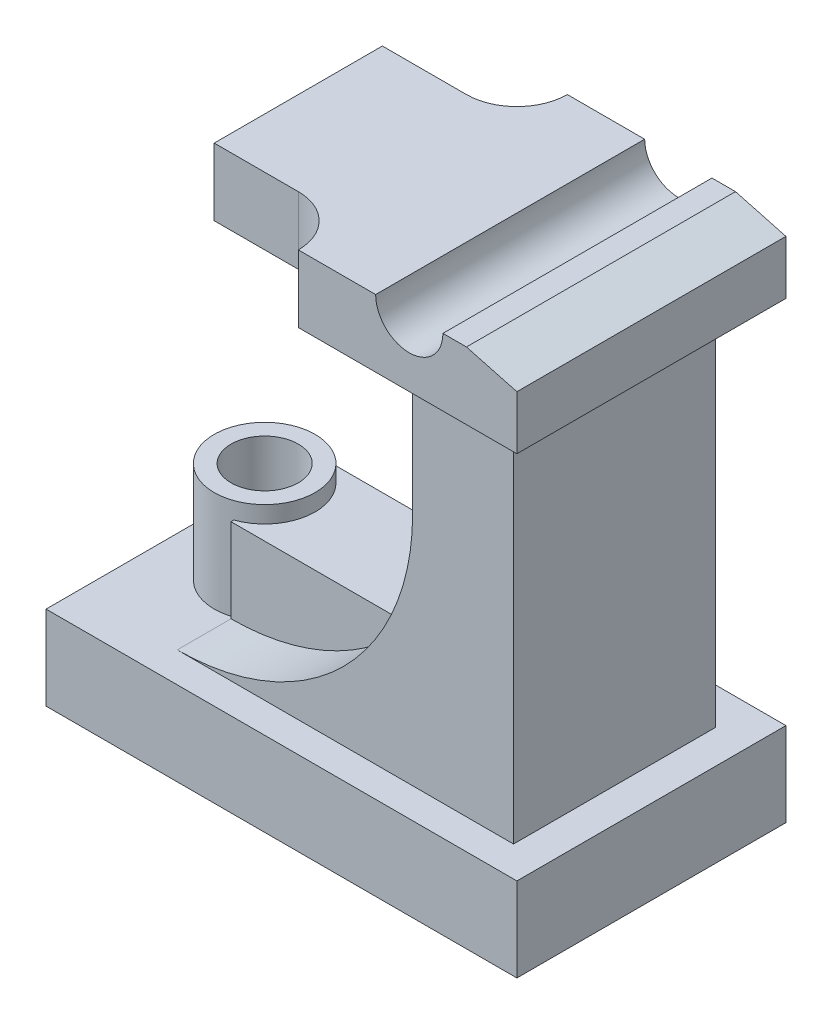
ISO-10303-21;
HEADER;
FILE_DESCRIPTION(('STEP AP214'),'2;1');
FILE_NAME('part.step','',(''),(''),'','','');
FILE_SCHEMA(('AUTOMOTIVE_DESIGN { 1 0 10303 214 1 1 1 1 }'));
ENDSEC;
DATA;
#1=APPLICATION_CONTEXT('core data for automotive mechanical design processes');
#2=APPLICATION_PROTOCOL_DEFINITION('international standard','automotive_design',2000,#1);
#3=PRODUCT_CONTEXT('',#1,'mechanical');
#4=PRODUCT('Part','Part','',(#3));
#5=PRODUCT_RELATED_PRODUCT_CATEGORY('part','',(#4));
#6=PRODUCT_DEFINITION_FORMATION('','',#4);
#7=PRODUCT_DEFINITION_CONTEXT('part definition',#1,'design');
#8=PRODUCT_DEFINITION('design','',#6,#7);
#9=PRODUCT_DEFINITION_SHAPE('','',#8);
#10=(LENGTH_UNIT() NAMED_UNIT(*) SI_UNIT(.MILLI.,.METRE.));
#11=(NAMED_UNIT(*) PLANE_ANGLE_UNIT() SI_UNIT($,.RADIAN.));
#12=(NAMED_UNIT(*) SI_UNIT($,.STERADIAN.) SOLID_ANGLE_UNIT());
#13=UNCERTAINTY_MEASURE_WITH_UNIT(LENGTH_MEASURE(1.E-05),#10,'distance_accuracy_value','');
#14=(GEOMETRIC_REPRESENTATION_CONTEXT(3) GLOBAL_UNCERTAINTY_ASSIGNED_CONTEXT((#13)) GLOBAL_UNIT_ASSIGNED_CONTEXT((#10,
#11,#12)) REPRESENTATION_CONTEXT('',''));
#15=CARTESIAN_POINT('',(0.,0.,0.));
#16=DIRECTION('',(0.,0.,1.));
#17=DIRECTION('',(1.,0.,0.));
#18=AXIS2_PLACEMENT_3D('',#15,#16,#17);
#19=CARTESIAN_POINT('',(0.,135.,0.));
#20=DIRECTION('',(0.,-1.,0.));
#21=DIRECTION('',(0.,0.,-1.));
#22=AXIS2_PLACEMENT_3D('',#19,#20,#21);
#23=PLANE('',#22);
#24=DIRECTION('',(1.,0.,0.));
#25=VECTOR('',#24,1.);
#26=CARTESIAN_POINT('',(-35.,135.,-25.));
#27=LINE('',#26,#25);
#28=CARTESIAN_POINT('',(-35.,135.,-25.));
#29=VERTEX_POINT('',#28);
#30=CARTESIAN_POINT('',(-9.99999999999999,135.,-25.));
#31=VERTEX_POINT('',#30);
#32=EDGE_CURVE('E221',#29,#31,#27,.T.);
#33=ORIENTED_EDGE('',*,*,#32,.T.);
#34=CARTESIAN_POINT('',(-9.99999999999999,135.,-40.));
#35=DIRECTION('',(0.,-1.,0.));
#36=DIRECTION('',(0.,0.,-1.));
#37=AXIS2_PLACEMENT_3D('',#34,#35,#36);
#38=CIRCLE('',#37,15.);
#39=CARTESIAN_POINT('',(5.00000000000001,135.,-40.));
#40=VERTEX_POINT('',#39);
#41=EDGE_CURVE('E214',#31,#40,#38,.F.);
#42=ORIENTED_EDGE('',*,*,#41,.T.);
#43=DIRECTION('',(1.,0.,0.));
#44=VECTOR('',#43,1.);
#45=CARTESIAN_POINT('',(-35.,135.,-40.));
#46=LINE('',#45,#44);
#47=CARTESIAN_POINT('',(70.,135.,-40.));
#48=VERTEX_POINT('',#47);
#49=EDGE_CURVE('E218',#40,#48,#46,.T.);
#50=ORIENTED_EDGE('',*,*,#49,.T.);
#51=DIRECTION('',(0.,0.,1.));
#52=VECTOR('',#51,1.);
#53=CARTESIAN_POINT('',(70.,135.,-40.));
#54=LINE('',#53,#52);
#55=CARTESIAN_POINT('',(70.,135.,40.));
#56=VERTEX_POINT('',#55);
#57=EDGE_CURVE('E237',#48,#56,#54,.T.);
#58=ORIENTED_EDGE('',*,*,#57,.T.);
#59=DIRECTION('',(-1.,0.,0.));
#60=VECTOR('',#59,1.);
#61=CARTESIAN_POINT('',(70.,135.,40.));
#62=LINE('',#61,#60);
#63=CARTESIAN_POINT('',(5.,135.,40.));
#64=VERTEX_POINT('',#63);
#65=EDGE_CURVE('E327',#56,#64,#62,.T.);
#66=ORIENTED_EDGE('',*,*,#65,.T.);
#67=CARTESIAN_POINT('',(-10.,135.,40.));
#68=DIRECTION('',(0.,-1.,0.));
#69=DIRECTION('',(0.,0.,-1.));
#70=AXIS2_PLACEMENT_3D('',#67,#68,#69);
#71=CIRCLE('',#70,15.);
#72=CARTESIAN_POINT('',(-9.99999999999999,135.,25.));
#73=VERTEX_POINT('',#72);
#74=EDGE_CURVE('E11',#64,#73,#71,.F.);
#75=ORIENTED_EDGE('',*,*,#74,.T.);
#76=DIRECTION('',(1.,0.,0.));
#77=VECTOR('',#76,1.);
#78=CARTESIAN_POINT('',(-35.,135.,25.));
#79=LINE('',#78,#77);
#80=CARTESIAN_POINT('',(-35.,135.,25.));
#81=VERTEX_POINT('',#80);
#82=EDGE_CURVE('E259',#81,#73,#79,.T.);
#83=ORIENTED_EDGE('',*,*,#82,.F.);
#84=DIRECTION('',(0.,0.,-1.));
#85=VECTOR('',#84,1.);
#86=CARTESIAN_POINT('',(-35.,135.,40.));
#87=LINE('',#86,#85);
#88=EDGE_CURVE('E238',#81,#29,#87,.T.);
#89=ORIENTED_EDGE('',*,*,#88,.T.);
#90=EDGE_LOOP('',(#33,#42,#50,#58,#66,#75,#83,#89));
#91=FACE_BOUND('',#90,.T.);
#92=DIRECTION('',(-1.,0.,0.));
#93=VECTOR('',#92,1.);
#94=CARTESIAN_POINT('',(60.,135.,31.0004667962898));
#95=LINE('',#94,#93);
#96=CARTESIAN_POINT('',(60.,135.,31.0004667962898));
#97=VERTEX_POINT('',#96);
#98=CARTESIAN_POINT('',(30.,135.,31.0004667962898));
#99=VERTEX_POINT('',#98);
#100=EDGE_CURVE('E363',#97,#99,#95,.T.);
#101=ORIENTED_EDGE('',*,*,#100,.F.);
#102=DIRECTION('',(0.,0.,1.));
#103=VECTOR('',#102,1.);
#104=CARTESIAN_POINT('',(60.,135.,-28.9995332037102));
#105=LINE('',#104,#103);
#106=CARTESIAN_POINT('',(60.,135.,-28.9995332037102));
#107=VERTEX_POINT('',#106);
#108=EDGE_CURVE('E376',#107,#97,#105,.T.);
#109=ORIENTED_EDGE('',*,*,#108,.F.);
#110=DIRECTION('',(1.,0.,0.));
#111=VECTOR('',#110,1.);
#112=CARTESIAN_POINT('',(30.,135.,-28.9995332037102));
#113=LINE('',#112,#111);
#114=CARTESIAN_POINT('',(30.,135.,-28.9995332037102));
#115=VERTEX_POINT('',#114);
#116=EDGE_CURVE('E372',#115,#107,#113,.T.);
#117=ORIENTED_EDGE('',*,*,#116,.F.);
#118=DIRECTION('',(0.,0.,-1.));
#119=VECTOR('',#118,1.);
#120=CARTESIAN_POINT('',(30.,135.,31.0004667962898));
#121=LINE('',#120,#119);
#122=EDGE_CURVE('E367',#99,#115,#121,.T.);
#123=ORIENTED_EDGE('',*,*,#122,.F.);
#124=EDGE_LOOP('',(#101,#109,#117,#123));
#125=FACE_BOUND('',#124,.T.);
#126=ADVANCED_FACE('F41',(#91,#125),#23,.T.);
#127=CARTESIAN_POINT('',(-35.,155.,40.));
#128=DIRECTION('',(-1.,0.,0.));
#129=DIRECTION('',(0.,0.,1.));
#130=AXIS2_PLACEMENT_3D('',#127,#128,#129);
#131=PLANE('',#130);
#132=DIRECTION('',(0.,1.,0.));
#133=VECTOR('',#132,1.);
#134=CARTESIAN_POINT('',(-35.,135.,-25.));
#135=LINE('',#134,#133);
#136=CARTESIAN_POINT('',(-35.,155.,-25.));
#137=VERTEX_POINT('',#136);
#138=EDGE_CURVE('E242',#29,#137,#135,.T.);
#139=ORIENTED_EDGE('',*,*,#138,.F.);
#140=ORIENTED_EDGE('',*,*,#88,.F.);
#141=DIRECTION('',(0.,1.,0.));
#142=VECTOR('',#141,1.);
#143=CARTESIAN_POINT('',(-35.,135.,25.));
#144=LINE('',#143,#142);
#145=CARTESIAN_POINT('',(-35.,155.,25.));
#146=VERTEX_POINT('',#145);
#147=EDGE_CURVE('E252',#81,#146,#144,.T.);
#148=ORIENTED_EDGE('',*,*,#147,.T.);
#149=DIRECTION('',(0.,0.,-1.));
#150=VECTOR('',#149,1.);
#151=CARTESIAN_POINT('',(-35.,155.,40.));
#152=LINE('',#151,#150);
#153=EDGE_CURVE('E322',#146,#137,#152,.T.);
#154=ORIENTED_EDGE('',*,*,#153,.T.);
#155=EDGE_LOOP('',(#139,#140,#148,#154));
#156=FACE_BOUND('',#155,.T.);
#157=ADVANCED_FACE('F533',(#156),#131,.T.);
#158=CARTESIAN_POINT('',(-35.,155.,-40.));
#159=DIRECTION('',(0.,0.,-1.));
#160=DIRECTION('',(-1.,0.,0.));
#161=AXIS2_PLACEMENT_3D('',#158,#159,#160);
#162=PLANE('',#161);
#163=ORIENTED_EDGE('',*,*,#49,.F.);
#164=DIRECTION('',(0.,1.,0.));
#165=VECTOR('',#164,1.);
#166=CARTESIAN_POINT('',(5.00000000000001,135.,-40.));
#167=LINE('',#166,#165);
#168=CARTESIAN_POINT('',(5.00000000000001,155.,-40.));
#169=VERTEX_POINT('',#168);
#170=EDGE_CURVE('E231',#40,#169,#167,.T.);
#171=ORIENTED_EDGE('',*,*,#170,.T.);
#172=DIRECTION('',(1.,0.,0.));
#173=VECTOR('',#172,1.);
#174=CARTESIAN_POINT('',(-35.,155.,-40.));
#175=LINE('',#174,#173);
#176=CARTESIAN_POINT('',(28.,155.,-40.));
#177=VERTEX_POINT('',#176);
#178=EDGE_CURVE('E328',#169,#177,#175,.T.);
#179=ORIENTED_EDGE('',*,*,#178,.T.);
#180=CARTESIAN_POINT('',(38.,155.,-40.));
#181=DIRECTION('',(0.,0.,1.));
#182=DIRECTION('',(1.,0.,0.));
#183=AXIS2_PLACEMENT_3D('',#180,#181,#182);
#184=CIRCLE('',#183,10.);
#185=CARTESIAN_POINT('',(48.,155.,-40.));
#186=VERTEX_POINT('',#185);
#187=EDGE_CURVE('E315',#177,#186,#184,.T.);
#188=ORIENTED_EDGE('',*,*,#187,.T.);
#189=CARTESIAN_POINT('',(54.9999999999998,155.,-40.));
#190=VERTEX_POINT('',#189);
#191=EDGE_CURVE('E326',#186,#190,#175,.T.);
#192=ORIENTED_EDGE('',*,*,#191,.T.);
#193=DIRECTION('',(0.965925826289069,-0.258819045102517,0.));
#194=VECTOR('',#193,1.);
#195=CARTESIAN_POINT('',(-28.9711431702999,177.5,-40.));
#196=LINE('',#195,#194);
#197=CARTESIAN_POINT('',(70.,150.980762113533,-40.));
#198=VERTEX_POINT('',#197);
#199=EDGE_CURVE('E648',#190,#198,#196,.T.);
#200=ORIENTED_EDGE('',*,*,#199,.T.);
#201=DIRECTION('',(0.,-1.,0.));
#202=VECTOR('',#201,1.);
#203=CARTESIAN_POINT('',(70.,155.,-40.));
#204=LINE('',#203,#202);
#205=EDGE_CURVE('E234',#198,#48,#204,.T.);
#206=ORIENTED_EDGE('',*,*,#205,.T.);
#207=EDGE_LOOP('',(#163,#171,#179,#188,#192,#200,#206));
#208=FACE_BOUND('',#207,.T.);
#209=ADVANCED_FACE('F230',(#208),#162,.T.);
#210=CARTESIAN_POINT('',(0.,155.,0.));
#211=DIRECTION('',(0.,-1.,0.));
#212=DIRECTION('',(0.,0.,-1.));
#213=AXIS2_PLACEMENT_3D('',#210,#211,#212);
#214=PLANE('',#213);
#215=ORIENTED_EDGE('',*,*,#178,.F.);
#216=CARTESIAN_POINT('',(-9.99999999999999,155.,-40.));
#217=DIRECTION('',(0.,-1.,0.));
#218=DIRECTION('',(0.,0.,-1.));
#219=AXIS2_PLACEMENT_3D('',#216,#217,#218);
#220=CIRCLE('',#219,15.);
#221=CARTESIAN_POINT('',(-9.99999999999999,155.,-25.));
#222=VERTEX_POINT('',#221);
#223=EDGE_CURVE('E226',#169,#222,#220,.T.);
#224=ORIENTED_EDGE('',*,*,#223,.T.);
#225=DIRECTION('',(1.,0.,0.));
#226=VECTOR('',#225,1.);
#227=CARTESIAN_POINT('',(-35.,155.,-25.));
#228=LINE('',#227,#226);
#229=EDGE_CURVE('E248',#137,#222,#228,.T.);
#230=ORIENTED_EDGE('',*,*,#229,.F.);
#231=ORIENTED_EDGE('',*,*,#153,.F.);
#232=DIRECTION('',(1.,0.,0.));
#233=VECTOR('',#232,1.);
#234=CARTESIAN_POINT('',(-35.,155.,25.));
#235=LINE('',#234,#233);
#236=CARTESIAN_POINT('',(-9.99999999999999,155.,25.));
#237=VERTEX_POINT('',#236);
#238=EDGE_CURVE('E260',#146,#237,#235,.T.);
#239=ORIENTED_EDGE('',*,*,#238,.T.);
#240=CARTESIAN_POINT('',(-10.,155.,40.));
#241=DIRECTION('',(0.,-1.,0.));
#242=DIRECTION('',(0.,0.,-1.));
#243=AXIS2_PLACEMENT_3D('',#240,#241,#242);
#244=CIRCLE('',#243,15.);
#245=CARTESIAN_POINT('',(4.99999999999999,155.,40.));
#246=VERTEX_POINT('',#245);
#247=EDGE_CURVE('E50',#237,#246,#244,.T.);
#248=ORIENTED_EDGE('',*,*,#247,.T.);
#249=DIRECTION('',(-1.,0.,0.));
#250=VECTOR('',#249,1.);
#251=CARTESIAN_POINT('',(70.,155.,40.));
#252=LINE('',#251,#250);
#253=CARTESIAN_POINT('',(28.,155.,40.));
#254=VERTEX_POINT('',#253);
#255=EDGE_CURVE('E331',#254,#246,#252,.T.);
#256=ORIENTED_EDGE('',*,*,#255,.F.);
#257=DIRECTION('',(0.,0.,1.));
#258=VECTOR('',#257,1.);
#259=CARTESIAN_POINT('',(28.,155.,-40.));
#260=LINE('',#259,#258);
#261=EDGE_CURVE('E471',#254,#177,#260,.F.);
#262=ORIENTED_EDGE('',*,*,#261,.T.);
#263=EDGE_LOOP('',(#215,#224,#230,#231,#239,#248,#256,#262));
#264=FACE_BOUND('',#263,.T.);
#265=ADVANCED_FACE('F531',(#264),#214,.F.);
#266=CARTESIAN_POINT('',(-40.,95.,0.));
#267=DIRECTION('',(0.,0.,1.));
#268=DIRECTION('',(1.,0.,0.));
#269=AXIS2_PLACEMENT_3D('',#266,#267,#268);
#270=CYLINDRICAL_SURFACE('',#269,70.);
#271=CARTESIAN_POINT('',(-40.,95.,15.));
#272=DIRECTION('',(0.,0.,-1.));
#273=DIRECTION('',(-1.,0.,0.));
#274=AXIS2_PLACEMENT_3D('',#271,#272,#273);
#275=CIRCLE('',#274,70.);
#276=CARTESIAN_POINT('',(-40.,25.,15.));
#277=VERTEX_POINT('',#276);
#278=CARTESIAN_POINT('',(13.619026473818,50.,15.));
#279=VERTEX_POINT('',#278);
#280=EDGE_CURVE('E311',#277,#279,#275,.F.);
#281=ORIENTED_EDGE('',*,*,#280,.F.);
#282=DIRECTION('',(0.,0.,-1.));
#283=VECTOR('',#282,1.);
#284=CARTESIAN_POINT('',(-40.,25.,-28.9995332037102));
#285=LINE('',#284,#283);
#286=CARTESIAN_POINT('',(-40.,25.,31.0004667962898));
#287=VERTEX_POINT('',#286);
#288=EDGE_CURVE('E446',#287,#277,#285,.T.);
#289=ORIENTED_EDGE('',*,*,#288,.F.);
#290=CARTESIAN_POINT('',(-40.,95.,31.0004667962898));
#291=DIRECTION('',(0.,0.,1.));
#292=DIRECTION('',(1.,0.,0.));
#293=AXIS2_PLACEMENT_3D('',#290,#291,#292);
#294=CIRCLE('',#293,70.);
#295=CARTESIAN_POINT('',(30.,95.,31.0004667962898));
#296=VERTEX_POINT('',#295);
#297=EDGE_CURVE('E457',#296,#287,#294,.F.);
#298=ORIENTED_EDGE('',*,*,#297,.F.);
#299=DIRECTION('',(0.,0.,-1.));
#300=VECTOR('',#299,1.);
#301=CARTESIAN_POINT('',(30.,95.,31.0004667962898));
#302=LINE('',#301,#300);
#303=CARTESIAN_POINT('',(30.,95.,-28.9995332037102));
#304=VERTEX_POINT('',#303);
#305=EDGE_CURVE('E450',#304,#296,#302,.F.);
#306=ORIENTED_EDGE('',*,*,#305,.F.);
#307=CARTESIAN_POINT('',(-40.,95.,-28.9995332037102));
#308=DIRECTION('',(0.,0.,-1.));
#309=DIRECTION('',(-1.,0.,0.));
#310=AXIS2_PLACEMENT_3D('',#307,#308,#309);
#311=CIRCLE('',#310,70.);
#312=CARTESIAN_POINT('',(-40.,25.,-28.9995332037102));
#313=VERTEX_POINT('',#312);
#314=EDGE_CURVE('E454',#313,#304,#311,.F.);
#315=ORIENTED_EDGE('',*,*,#314,.F.);
#316=CARTESIAN_POINT('',(-40.,25.,-15.));
#317=VERTEX_POINT('',#316);
#318=EDGE_CURVE('E445',#317,#313,#285,.T.);
#319=ORIENTED_EDGE('',*,*,#318,.F.);
#320=CARTESIAN_POINT('',(-40.,95.,-15.));
#321=DIRECTION('',(0.,0.,-1.));
#322=DIRECTION('',(-1.,0.,0.));
#323=AXIS2_PLACEMENT_3D('',#320,#321,#322);
#324=CIRCLE('',#323,70.);
#325=CARTESIAN_POINT('',(13.619026473818,50.,-15.));
#326=VERTEX_POINT('',#325);
#327=EDGE_CURVE('E307',#317,#326,#324,.F.);
#328=ORIENTED_EDGE('',*,*,#327,.T.);
#329=DIRECTION('',(0.,0.,1.));
#330=VECTOR('',#329,1.);
#331=CARTESIAN_POINT('',(13.619026473818,50.,0.));
#332=LINE('',#331,#330);
#333=EDGE_CURVE('E303',#326,#279,#332,.T.);
#334=ORIENTED_EDGE('',*,*,#333,.T.);
#335=EDGE_LOOP('',(#281,#289,#298,#306,#315,#319,#328,#334));
#336=FACE_BOUND('',#335,.T.);
#337=ADVANCED_FACE('F528',(#336),#270,.F.);
#338=CARTESIAN_POINT('',(54.9999999999998,155.,40.));
#339=VERTEX_POINT('',#338);
#340=CARTESIAN_POINT('',(48.,155.,40.));
#341=VERTEX_POINT('',#340);
#342=EDGE_CURVE('E332',#339,#341,#252,.T.);
#343=ORIENTED_EDGE('',*,*,#342,.F.);
#344=DIRECTION('',(0.,0.,-1.));
#345=VECTOR('',#344,1.);
#346=CARTESIAN_POINT('',(54.9999999999998,155.,-40.));
#347=LINE('',#346,#345);
#348=EDGE_CURVE('E645',#339,#190,#347,.T.);
#349=ORIENTED_EDGE('',*,*,#348,.T.);
#350=ORIENTED_EDGE('',*,*,#191,.F.);
#351=DIRECTION('',(0.,0.,1.));
#352=VECTOR('',#351,1.);
#353=CARTESIAN_POINT('',(48.,155.,-40.));
#354=LINE('',#353,#352);
#355=EDGE_CURVE('E628',#186,#341,#354,.T.);
#356=ORIENTED_EDGE('',*,*,#355,.T.);
#357=EDGE_LOOP('',(#343,#349,#350,#356));
#358=FACE_BOUND('',#357,.T.);
#359=ADVANCED_FACE('F523',(#358),#214,.F.);
#360=CARTESIAN_POINT('',(70.,25.,-40.));
#361=DIRECTION('',(-1.,0.,0.));
#362=DIRECTION('',(0.,0.,1.));
#363=AXIS2_PLACEMENT_3D('',#360,#361,#362);
#364=PLANE('',#363);
#365=DIRECTION('',(0.,0.,-1.));
#366=VECTOR('',#365,1.);
#367=CARTESIAN_POINT('',(70.,0.,-40.));
#368=LINE('',#367,#366);
#369=CARTESIAN_POINT('',(70.,0.,40.));
#370=VERTEX_POINT('',#369);
#371=CARTESIAN_POINT('',(70.,0.,-40.));
#372=VERTEX_POINT('',#371);
#373=EDGE_CURVE('E392',#370,#372,#368,.T.);
#374=ORIENTED_EDGE('',*,*,#373,.T.);
#375=DIRECTION('',(0.,-1.,0.));
#376=VECTOR('',#375,1.);
#377=CARTESIAN_POINT('',(70.,25.,-40.));
#378=LINE('',#377,#376);
#379=CARTESIAN_POINT('',(70.,25.,-40.));
#380=VERTEX_POINT('',#379);
#381=EDGE_CURVE('E441',#380,#372,#378,.T.);
#382=ORIENTED_EDGE('',*,*,#381,.F.);
#383=DIRECTION('',(0.,0.,-1.));
#384=VECTOR('',#383,1.);
#385=CARTESIAN_POINT('',(70.,25.,-40.));
#386=LINE('',#385,#384);
#387=CARTESIAN_POINT('',(70.,25.,40.));
#388=VERTEX_POINT('',#387);
#389=EDGE_CURVE('E404',#388,#380,#386,.T.);
#390=ORIENTED_EDGE('',*,*,#389,.F.);
#391=DIRECTION('',(0.,-1.,0.));
#392=VECTOR('',#391,1.);
#393=CARTESIAN_POINT('',(70.,25.,40.));
#394=LINE('',#393,#392);
#395=EDGE_CURVE('E418',#388,#370,#394,.T.);
#396=ORIENTED_EDGE('',*,*,#395,.T.);
#397=EDGE_LOOP('',(#374,#382,#390,#396));
#398=FACE_BOUND('',#397,.T.);
#399=ADVANCED_FACE('F520',(#398),#364,.F.);
#400=CARTESIAN_POINT('',(-70.,25.,-40.));
#401=DIRECTION('',(0.,0.,1.));
#402=DIRECTION('',(1.,0.,0.));
#403=AXIS2_PLACEMENT_3D('',#400,#401,#402);
#404=PLANE('',#403);
#405=DIRECTION('',(-1.,0.,0.));
#406=VECTOR('',#405,1.);
#407=CARTESIAN_POINT('',(-70.,0.,-40.));
#408=LINE('',#407,#406);
#409=CARTESIAN_POINT('',(-70.,0.,-40.));
#410=VERTEX_POINT('',#409);
#411=EDGE_CURVE('E422',#372,#410,#408,.T.);
#412=ORIENTED_EDGE('',*,*,#411,.T.);
#413=DIRECTION('',(0.,-1.,0.));
#414=VECTOR('',#413,1.);
#415=CARTESIAN_POINT('',(-70.,25.,-40.));
#416=LINE('',#415,#414);
#417=CARTESIAN_POINT('',(-70.,25.,-40.));
#418=VERTEX_POINT('',#417);
#419=EDGE_CURVE('E437',#418,#410,#416,.T.);
#420=ORIENTED_EDGE('',*,*,#419,.F.);
#421=DIRECTION('',(-1.,0.,0.));
#422=VECTOR('',#421,1.);
#423=CARTESIAN_POINT('',(-70.,25.,-40.));
#424=LINE('',#423,#422);
#425=EDGE_CURVE('E408',#380,#418,#424,.T.);
#426=ORIENTED_EDGE('',*,*,#425,.F.);
#427=ORIENTED_EDGE('',*,*,#381,.T.);
#428=EDGE_LOOP('',(#412,#420,#426,#427));
#429=FACE_BOUND('',#428,.T.);
#430=ADVANCED_FACE('F517',(#429),#404,.F.);
#431=CARTESIAN_POINT('',(-70.,25.,-40.));
#432=DIRECTION('',(1.,0.,0.));
#433=DIRECTION('',(0.,0.,-1.));
#434=AXIS2_PLACEMENT_3D('',#431,#432,#433);
#435=PLANE('',#434);
#436=DIRECTION('',(0.,0.,1.));
#437=VECTOR('',#436,1.);
#438=CARTESIAN_POINT('',(-70.,0.,-40.));
#439=LINE('',#438,#437);
#440=CARTESIAN_POINT('',(-70.,0.,40.));
#441=VERTEX_POINT('',#440);
#442=EDGE_CURVE('E425',#410,#441,#439,.T.);
#443=ORIENTED_EDGE('',*,*,#442,.T.);
#444=DIRECTION('',(0.,-1.,0.));
#445=VECTOR('',#444,1.);
#446=CARTESIAN_POINT('',(-70.,25.,40.));
#447=LINE('',#446,#445);
#448=CARTESIAN_POINT('',(-70.,25.,40.));
#449=VERTEX_POINT('',#448);
#450=EDGE_CURVE('E433',#449,#441,#447,.T.);
#451=ORIENTED_EDGE('',*,*,#450,.F.);
#452=DIRECTION('',(0.,0.,1.));
#453=VECTOR('',#452,1.);
#454=CARTESIAN_POINT('',(-70.,25.,-40.));
#455=LINE('',#454,#453);
#456=EDGE_CURVE('E412',#418,#449,#455,.T.);
#457=ORIENTED_EDGE('',*,*,#456,.F.);
#458=ORIENTED_EDGE('',*,*,#419,.T.);
#459=EDGE_LOOP('',(#443,#451,#457,#458));
#460=FACE_BOUND('',#459,.T.);
#461=ADVANCED_FACE('F513',(#460),#435,.F.);
#462=CARTESIAN_POINT('',(-70.,25.,40.));
#463=DIRECTION('',(0.,0.,-1.));
#464=DIRECTION('',(-1.,0.,0.));
#465=AXIS2_PLACEMENT_3D('',#462,#463,#464);
#466=PLANE('',#465);
#467=DIRECTION('',(1.,0.,0.));
#468=VECTOR('',#467,1.);
#469=CARTESIAN_POINT('',(-70.,0.,40.));
#470=LINE('',#469,#468);
#471=EDGE_CURVE('E409',#441,#370,#470,.T.);
#472=ORIENTED_EDGE('',*,*,#471,.T.);
#473=ORIENTED_EDGE('',*,*,#395,.F.);
#474=DIRECTION('',(1.,0.,0.));
#475=VECTOR('',#474,1.);
#476=CARTESIAN_POINT('',(-70.,25.,40.));
#477=LINE('',#476,#475);
#478=EDGE_CURVE('E415',#449,#388,#477,.T.);
#479=ORIENTED_EDGE('',*,*,#478,.F.);
#480=ORIENTED_EDGE('',*,*,#450,.T.);
#481=EDGE_LOOP('',(#472,#473,#479,#480));
#482=FACE_BOUND('',#481,.T.);
#483=ADVANCED_FACE('F505',(#482),#466,.F.);
#484=CARTESIAN_POINT('',(0.,25.,0.));
#485=DIRECTION('',(0.,1.,0.));
#486=DIRECTION('',(0.,0.,1.));
#487=AXIS2_PLACEMENT_3D('',#484,#485,#486);
#488=PLANE('',#487);
#489=ORIENTED_EDGE('',*,*,#288,.T.);
#490=DIRECTION('',(0.,0.,-1.));
#491=VECTOR('',#490,1.);
#492=CARTESIAN_POINT('',(-40.,25.,0.));
#493=LINE('',#492,#491);
#494=CARTESIAN_POINT('',(-40.,25.,14.142135623731));
#495=VERTEX_POINT('',#494);
#496=EDGE_CURVE('E246',#277,#495,#493,.T.);
#497=ORIENTED_EDGE('',*,*,#496,.T.);
#498=CARTESIAN_POINT('',(-45.,25.,0.));
#499=DIRECTION('',(0.,1.,0.));
#500=DIRECTION('',(0.,0.,1.));
#501=AXIS2_PLACEMENT_3D('',#498,#499,#500);
#502=CIRCLE('',#501,15.);
#503=CARTESIAN_POINT('',(-40.,25.,-14.142135623731));
#504=VERTEX_POINT('',#503);
#505=EDGE_CURVE('E352',#504,#495,#502,.T.);
#506=ORIENTED_EDGE('',*,*,#505,.F.);
#507=EDGE_CURVE('E570',#504,#317,#285,.T.);
#508=ORIENTED_EDGE('',*,*,#507,.T.);
#509=ORIENTED_EDGE('',*,*,#318,.T.);
#510=DIRECTION('',(1.,0.,0.));
#511=VECTOR('',#510,1.);
#512=CARTESIAN_POINT('',(30.,25.,-28.9995332037102));
#513=LINE('',#512,#511);
#514=CARTESIAN_POINT('',(60.,25.,-28.9995332037102));
#515=VERTEX_POINT('',#514);
#516=EDGE_CURVE('E383',#313,#515,#513,.T.);
#517=ORIENTED_EDGE('',*,*,#516,.T.);
#518=DIRECTION('',(0.,0.,1.));
#519=VECTOR('',#518,1.);
#520=CARTESIAN_POINT('',(60.,25.,-28.9995332037102));
#521=LINE('',#520,#519);
#522=CARTESIAN_POINT('',(60.,25.,31.0004667962898));
#523=VERTEX_POINT('',#522);
#524=EDGE_CURVE('E368',#515,#523,#521,.T.);
#525=ORIENTED_EDGE('',*,*,#524,.T.);
#526=DIRECTION('',(-1.,0.,0.));
#527=VECTOR('',#526,1.);
#528=CARTESIAN_POINT('',(60.,25.,31.0004667962898));
#529=LINE('',#528,#527);
#530=EDGE_CURVE('E356',#523,#287,#529,.T.);
#531=ORIENTED_EDGE('',*,*,#530,.T.);
#532=EDGE_LOOP('',(#489,#497,#506,#508,#509,#517,#525,#531));
#533=FACE_BOUND('',#532,.T.);
#534=ORIENTED_EDGE('',*,*,#389,.T.);
#535=ORIENTED_EDGE('',*,*,#425,.T.);
#536=ORIENTED_EDGE('',*,*,#456,.T.);
#537=ORIENTED_EDGE('',*,*,#478,.T.);
#538=EDGE_LOOP('',(#534,#535,#536,#537));
#539=FACE_BOUND('',#538,.T.);
#540=ADVANCED_FACE('F502',(#533,#539),#488,.T.);
#541=CARTESIAN_POINT('',(0.,0.,0.));
#542=DIRECTION('',(0.,1.,0.));
#543=DIRECTION('',(0.,0.,1.));
#544=AXIS2_PLACEMENT_3D('',#541,#542,#543);
#545=PLANE('',#544);
#546=ORIENTED_EDGE('',*,*,#373,.F.);
#547=ORIENTED_EDGE('',*,*,#471,.F.);
#548=ORIENTED_EDGE('',*,*,#442,.F.);
#549=ORIENTED_EDGE('',*,*,#411,.F.);
#550=EDGE_LOOP('',(#546,#547,#548,#549));
#551=FACE_BOUND('',#550,.T.);
#552=ADVANCED_FACE('F500',(#551),#545,.F.);
#553=CARTESIAN_POINT('',(60.,135.,31.0004667962898));
#554=DIRECTION('',(0.,0.,1.));
#555=DIRECTION('',(1.,0.,0.));
#556=AXIS2_PLACEMENT_3D('',#553,#554,#555);
#557=PLANE('',#556);
#558=ORIENTED_EDGE('',*,*,#530,.F.);
#559=DIRECTION('',(0.,-1.,0.));
#560=VECTOR('',#559,1.);
#561=CARTESIAN_POINT('',(60.,135.,31.0004667962898));
#562=LINE('',#561,#560);
#563=EDGE_CURVE('E388',#97,#523,#562,.T.);
#564=ORIENTED_EDGE('',*,*,#563,.F.);
#565=ORIENTED_EDGE('',*,*,#100,.T.);
#566=DIRECTION('',(0.,-1.,0.));
#567=VECTOR('',#566,1.);
#568=CARTESIAN_POINT('',(30.,135.,31.0004667962898));
#569=LINE('',#568,#567);
#570=EDGE_CURVE('E380',#99,#296,#569,.T.);
#571=ORIENTED_EDGE('',*,*,#570,.T.);
#572=ORIENTED_EDGE('',*,*,#297,.T.);
#573=EDGE_LOOP('',(#558,#564,#565,#571,#572));
#574=FACE_BOUND('',#573,.T.);
#575=ADVANCED_FACE('F490',(#574),#557,.T.);
#576=CARTESIAN_POINT('',(60.,135.,-28.9995332037102));
#577=DIRECTION('',(1.,0.,0.));
#578=DIRECTION('',(0.,0.,-1.));
#579=AXIS2_PLACEMENT_3D('',#576,#577,#578);
#580=PLANE('',#579);
#581=ORIENTED_EDGE('',*,*,#524,.F.);
#582=DIRECTION('',(0.,-1.,0.));
#583=VECTOR('',#582,1.);
#584=CARTESIAN_POINT('',(60.,135.,-28.9995332037102));
#585=LINE('',#584,#583);
#586=EDGE_CURVE('E393',#107,#515,#585,.T.);
#587=ORIENTED_EDGE('',*,*,#586,.F.);
#588=ORIENTED_EDGE('',*,*,#108,.T.);
#589=ORIENTED_EDGE('',*,*,#563,.T.);
#590=EDGE_LOOP('',(#581,#587,#588,#589));
#591=FACE_BOUND('',#590,.T.);
#592=ADVANCED_FACE('F486',(#591),#580,.T.);
#593=CARTESIAN_POINT('',(30.,135.,-28.9995332037102));
#594=DIRECTION('',(0.,0.,-1.));
#595=DIRECTION('',(-1.,0.,0.));
#596=AXIS2_PLACEMENT_3D('',#593,#594,#595);
#597=PLANE('',#596);
#598=ORIENTED_EDGE('',*,*,#516,.F.);
#599=ORIENTED_EDGE('',*,*,#314,.T.);
#600=DIRECTION('',(0.,-1.,0.));
#601=VECTOR('',#600,1.);
#602=CARTESIAN_POINT('',(30.,135.,-28.9995332037102));
#603=LINE('',#602,#601);
#604=EDGE_CURVE('E397',#115,#304,#603,.T.);
#605=ORIENTED_EDGE('',*,*,#604,.F.);
#606=ORIENTED_EDGE('',*,*,#116,.T.);
#607=ORIENTED_EDGE('',*,*,#586,.T.);
#608=EDGE_LOOP('',(#598,#599,#605,#606,#607));
#609=FACE_BOUND('',#608,.T.);
#610=ADVANCED_FACE('F489',(#609),#597,.T.);
#611=CARTESIAN_POINT('',(30.,135.,31.0004667962898));
#612=DIRECTION('',(-1.,0.,0.));
#613=DIRECTION('',(0.,0.,1.));
#614=AXIS2_PLACEMENT_3D('',#611,#612,#613);
#615=PLANE('',#614);
#616=ORIENTED_EDGE('',*,*,#604,.T.);
#617=ORIENTED_EDGE('',*,*,#305,.T.);
#618=ORIENTED_EDGE('',*,*,#570,.F.);
#619=ORIENTED_EDGE('',*,*,#122,.T.);
#620=EDGE_LOOP('',(#616,#617,#618,#619));
#621=FACE_BOUND('',#620,.T.);
#622=ADVANCED_FACE('F483',(#621),#615,.T.);
#623=CARTESIAN_POINT('',(-45.,55.,0.));
#624=DIRECTION('',(0.,-1.,0.));
#625=DIRECTION('',(0.,0.,-1.));
#626=AXIS2_PLACEMENT_3D('',#623,#624,#625);
#627=CYLINDRICAL_SURFACE('',#626,10.);
#628=CARTESIAN_POINT('',(-45.,55.,0.));
#629=DIRECTION('',(0.,1.,0.));
#630=DIRECTION('',(0.,0.,1.));
#631=AXIS2_PLACEMENT_3D('',#628,#629,#630);
#632=CIRCLE('',#631,10.);
#633=CARTESIAN_POINT('',(-45.,55.,10.));
#634=VERTEX_POINT('',#633);
#635=EDGE_CURVE('E347',#634,#634,#632,.T.);
#636=ORIENTED_EDGE('',*,*,#635,.T.);
#637=EDGE_LOOP('',(#636));
#638=FACE_BOUND('',#637,.T.);
#639=CARTESIAN_POINT('',(-40.,25.,8.6602540378444));
#640=CARTESIAN_POINT('',(-39.7566634541676,24.9999927406852,8.5197991223465));
#641=CARTESIAN_POINT('',(-39.5192847127691,25.001268822178,8.36904160511734));
#642=CARTESIAN_POINT('',(-39.0580755201664,25.0059595923181,8.04812321644509));
#643=CARTESIAN_POINT('',(-38.834244007651,25.0093741131983,7.87796386799147));
#644=CARTESIAN_POINT('',(-38.4018944855377,25.0179104403205,7.5195631871239));
#645=CARTESIAN_POINT('',(-38.1933644924808,25.0230308927584,7.33133627693651));
#646=CARTESIAN_POINT('',(-37.7928897293451,25.0345172034623,6.93803404080334));
#647=CARTESIAN_POINT('',(-37.6009448966855,25.0408830570288,6.73295877843703));
#648=CARTESIAN_POINT('',(-37.2349275106299,25.0543929833325,6.3073339469899));
#649=CARTESIAN_POINT('',(-37.060861261374,25.0615373287551,6.08677896545908));
#650=CARTESIAN_POINT('',(-36.7319017150671,25.076136762703,5.63181600416845));
#651=CARTESIAN_POINT('',(-36.5770084376363,25.0835918515463,5.39740801023281));
#652=CARTESIAN_POINT('',(-36.2875088700947,25.098366083971,4.91642895303609));
#653=CARTESIAN_POINT('',(-36.1528993732872,25.1056852488801,4.66985982054771));
#654=CARTESIAN_POINT('',(-35.9048892724834,25.119777446192,4.1662621636806));
#655=CARTESIAN_POINT('',(-35.7914886020525,25.1265504803053,3.9092336720678));
#656=CARTESIAN_POINT('',(-35.5865092230309,25.1391978898091,3.38604118705454));
#657=CARTESIAN_POINT('',(-35.4949716541843,25.1450705636762,3.11986103254186));
#658=CARTESIAN_POINT('',(-35.3346478791256,25.1555947131484,2.58071023377393));
#659=CARTESIAN_POINT('',(-35.2658617381651,25.1602461852512,2.30773957004579));
#660=CARTESIAN_POINT('',(-35.1515290379315,25.1680902587126,1.75691490300123));
#661=CARTESIAN_POINT('',(-35.1059855791107,25.1712826654336,1.47906025329775));
#662=CARTESIAN_POINT('',(-35.0384819151184,25.1760464720664,0.920487394130073));
#663=CARTESIAN_POINT('',(-35.0165216473389,25.1776178762815,0.639769192269949));
#664=CARTESIAN_POINT('',(-34.9963647830276,25.1790594672232,0.0780688843010767));
#665=CARTESIAN_POINT('',(-34.9981182497936,25.1789332288715,-0.202911421718602));
#666=CARTESIAN_POINT('',(-35.025254943027,25.1769945104264,-0.763722638659946));
#667=CARTESIAN_POINT('',(-35.0506381518065,25.1751820315953,-1.04355355044183));
#668=CARTESIAN_POINT('',(-35.1248458819046,25.1699616760829,-1.60003618771613));
#669=CARTESIAN_POINT('',(-35.1736672687775,25.1665540127313,-1.87668833324884));
#670=CARTESIAN_POINT('',(-35.2943983024523,25.1583149651442,-2.42488550317679));
#671=CARTESIAN_POINT('',(-35.3663079060699,25.1534835835716,-2.69643053712338));
#672=CARTESIAN_POINT('',(-35.5326373128876,25.1426481740391,-3.23228823639553));
#673=CARTESIAN_POINT('',(-35.6270401698903,25.1366450294865,-3.49660618022317));
#674=CARTESIAN_POINT('',(-35.8377151889323,25.1237771876561,-4.01636301256331));
#675=CARTESIAN_POINT('',(-35.953987863931,25.1169124701711,-4.27180169264499));
#676=CARTESIAN_POINT('',(-36.2076378163864,25.1026887322122,-4.77211347992268));
#677=CARTESIAN_POINT('',(-36.3450250205041,25.0953294801613,-5.01698154779414));
#678=CARTESIAN_POINT('',(-36.6398901759827,25.0805360322526,-5.49429283399993));
#679=CARTESIAN_POINT('',(-36.7973674540249,25.0731018389141,-5.72673646836878));
#680=CARTESIAN_POINT('',(-37.131846803675,25.0585830904553,-6.17829803174151));
#681=CARTESIAN_POINT('',(-37.3089101161419,25.0514997383325,-6.39737063885387));
#682=CARTESIAN_POINT('',(-37.6808914185852,25.0381793008792,-6.81981295045664));
#683=CARTESIAN_POINT('',(-37.8758088292813,25.0319421881085,-7.02318316402053));
#684=CARTESIAN_POINT('',(-38.2817759962273,25.0207968678444,-7.41245129751742));
#685=CARTESIAN_POINT('',(-38.4927986374269,25.0158864872881,-7.59837745902334));
#686=CARTESIAN_POINT('',(-38.9296827115117,25.0078426748688,-7.95173587319314));
#687=CARTESIAN_POINT('',(-39.1555355440565,25.0047082230874,-8.11917869628062));
#688=CARTESIAN_POINT('',(-39.4876954454228,25.0018035475525,-8.34440123310928));
#689=CARTESIAN_POINT('',(-39.5886297518222,25.0011343033378,-8.41020764936742));
#690=CARTESIAN_POINT('',(-39.7926786476658,25.0002327721068,-8.53804856582852));
#691=CARTESIAN_POINT('',(-39.8957902321204,24.9999999181694,-8.60008785837241));
#692=CARTESIAN_POINT('',(-40.,25.,-8.66025403784441));
#693=B_SPLINE_CURVE_WITH_KNOTS('',3,(#639,#640,#641,#642,#643,#644,#645,#646,#647,#648,#649,
#650,#651,#652,#653,#654,#655,#656,#657,#658,#659,#660,#661,#662,#663,#664,#665,#666,#667,#668,
#669,#670,#671,#672,#673,#674,#675,#676,#677,#678,#679,#680,#681,#682,#683,#684,#685,#686,#687,
#688,#689,#690,#691,#692),.UNSPECIFIED.,.F.,.F.,(4,2,2,2,2,2,2,2,2,2,2,2,2,2,2,2,2,2,2,2,2,2,2,
2,2,2,4),(0.,0.8426237902537,1.685181482374,2.52707211854574,3.36895957787841,4.21114288204973,
5.05332704804534,5.89537793174386,6.73742617776196,7.58104663618028,8.42466951409575,
9.26840489749778,10.1121380409689,10.9540947169556,11.7960507627006,12.6378942429233,
13.4797361485686,14.3209458130659,15.1621752107063,16.0038013157166,16.8453992210396,
17.6897072448841,18.5339878846579,19.3768771716952,20.2192818943213,20.5806972017598,
20.9416426629853),.UNSPECIFIED.);
#694=CARTESIAN_POINT('',(-40.,25.,8.6602540378444));
#695=VERTEX_POINT('',#694);
#696=CARTESIAN_POINT('',(-40.,25.,-8.6602540378444));
#697=VERTEX_POINT('',#696);
#698=EDGE_CURVE('E461',#695,#697,#693,.T.);
#699=ORIENTED_EDGE('',*,*,#698,.F.);
#700=CARTESIAN_POINT('',(-45.,25.,0.));
#701=DIRECTION('',(0.,1.,0.));
#702=DIRECTION('',(0.,0.,1.));
#703=AXIS2_PLACEMENT_3D('',#700,#701,#702);
#704=CIRCLE('',#703,10.);
#705=EDGE_CURVE('E344',#697,#695,#704,.T.);
#706=ORIENTED_EDGE('',*,*,#705,.F.);
#707=EDGE_LOOP('',(#699,#706));
#708=FACE_BOUND('',#707,.T.);
#709=ADVANCED_FACE('F477',(#638,#708),#627,.F.);
#710=CARTESIAN_POINT('',(-45.,55.,0.));
#711=DIRECTION('',(0.,-1.,0.));
#712=DIRECTION('',(0.,0.,-1.));
#713=AXIS2_PLACEMENT_3D('',#710,#711,#712);
#714=CYLINDRICAL_SURFACE('',#713,15.);
#715=ORIENTED_EDGE('',*,*,#505,.T.);
#716=DIRECTION('',(0.,-1.,0.));
#717=VECTOR('',#716,1.);
#718=CARTESIAN_POINT('',(-40.,50.,14.142135623731));
#719=LINE('',#718,#717);
#720=CARTESIAN_POINT('',(-40.,50.,14.142135623731));
#721=VERTEX_POINT('',#720);
#722=EDGE_CURVE('E300',#721,#495,#719,.T.);
#723=ORIENTED_EDGE('',*,*,#722,.F.);
#724=CARTESIAN_POINT('',(-45.,50.,0.));
#725=DIRECTION('',(0.,1.,0.));
#726=DIRECTION('',(0.,0.,1.));
#727=AXIS2_PLACEMENT_3D('',#724,#725,#726);
#728=CIRCLE('',#727,15.);
#729=CARTESIAN_POINT('',(-40.,50.,-14.142135623731));
#730=VERTEX_POINT('',#729);
#731=EDGE_CURVE('E266',#721,#730,#728,.T.);
#732=ORIENTED_EDGE('',*,*,#731,.T.);
#733=DIRECTION('',(0.,-1.,0.));
#734=VECTOR('',#733,1.);
#735=CARTESIAN_POINT('',(-40.,50.,-14.142135623731));
#736=LINE('',#735,#734);
#737=EDGE_CURVE('E286',#730,#504,#736,.T.);
#738=ORIENTED_EDGE('',*,*,#737,.T.);
#739=EDGE_LOOP('',(#715,#723,#732,#738));
#740=FACE_BOUND('',#739,.T.);
#741=CARTESIAN_POINT('',(-45.,55.,0.));
#742=DIRECTION('',(0.,1.,0.));
#743=DIRECTION('',(0.,0.,1.));
#744=AXIS2_PLACEMENT_3D('',#741,#742,#743);
#745=CIRCLE('',#744,15.);
#746=CARTESIAN_POINT('',(-45.,55.,15.));
#747=VERTEX_POINT('',#746);
#748=EDGE_CURVE('E351',#747,#747,#745,.T.);
#749=ORIENTED_EDGE('',*,*,#748,.F.);
#750=EDGE_LOOP('',(#749));
#751=FACE_BOUND('',#750,.T.);
#752=ADVANCED_FACE('F482',(#740,#751),#714,.T.);
#753=CARTESIAN_POINT('',(0.,55.,0.));
#754=DIRECTION('',(0.,1.,0.));
#755=DIRECTION('',(0.,0.,1.));
#756=AXIS2_PLACEMENT_3D('',#753,#754,#755);
#757=PLANE('',#756);
#758=ORIENTED_EDGE('',*,*,#635,.F.);
#759=EDGE_LOOP('',(#758));
#760=FACE_BOUND('',#759,.T.);
#761=ORIENTED_EDGE('',*,*,#748,.T.);
#762=EDGE_LOOP('',(#761));
#763=FACE_BOUND('',#762,.T.);
#764=ADVANCED_FACE('F552',(#760,#763),#757,.T.);
#765=EDGE_CURVE('E451',#695,#697,#285,.T.);
#766=ORIENTED_EDGE('',*,*,#765,.F.);
#767=ORIENTED_EDGE('',*,*,#698,.T.);
#768=EDGE_LOOP('',(#766,#767));
#769=FACE_BOUND('',#768,.T.);
#770=ADVANCED_FACE('F473',(#769),#270,.F.);
#771=ORIENTED_EDGE('',*,*,#705,.T.);
#772=ORIENTED_EDGE('',*,*,#765,.T.);
#773=EDGE_LOOP('',(#771,#772));
#774=FACE_BOUND('',#773,.T.);
#775=ADVANCED_FACE('F507',(#774),#488,.T.);
#776=CARTESIAN_POINT('',(70.,155.,40.));
#777=DIRECTION('',(0.,0.,1.));
#778=DIRECTION('',(1.,0.,0.));
#779=AXIS2_PLACEMENT_3D('',#776,#777,#778);
#780=PLANE('',#779);
#781=DIRECTION('',(0.,1.,0.));
#782=VECTOR('',#781,1.);
#783=CARTESIAN_POINT('',(5.,135.,40.));
#784=LINE('',#783,#782);
#785=EDGE_CURVE('E256',#64,#246,#784,.T.);
#786=ORIENTED_EDGE('',*,*,#785,.F.);
#787=ORIENTED_EDGE('',*,*,#65,.F.);
#788=DIRECTION('',(0.,-1.,0.));
#789=VECTOR('',#788,1.);
#790=CARTESIAN_POINT('',(70.,155.,40.));
#791=LINE('',#790,#789);
#792=CARTESIAN_POINT('',(70.,150.980762113533,40.));
#793=VERTEX_POINT('',#792);
#794=EDGE_CURVE('E341',#793,#56,#791,.T.);
#795=ORIENTED_EDGE('',*,*,#794,.F.);
#796=DIRECTION('',(-0.965925826289069,0.258819045102517,0.));
#797=VECTOR('',#796,1.);
#798=CARTESIAN_POINT('',(68.9951905283833,151.25,40.));
#799=LINE('',#798,#797);
#800=EDGE_CURVE('E640',#793,#339,#799,.T.);
#801=ORIENTED_EDGE('',*,*,#800,.T.);
#802=ORIENTED_EDGE('',*,*,#342,.T.);
#803=CARTESIAN_POINT('',(38.,155.,40.));
#804=DIRECTION('',(0.,0.,1.));
#805=DIRECTION('',(1.,0.,0.));
#806=AXIS2_PLACEMENT_3D('',#803,#804,#805);
#807=CIRCLE('',#806,10.);
#808=EDGE_CURVE('E314',#254,#341,#807,.T.);
#809=ORIENTED_EDGE('',*,*,#808,.F.);
#810=ORIENTED_EDGE('',*,*,#255,.T.);
#811=EDGE_LOOP('',(#786,#787,#795,#801,#802,#809,#810));
#812=FACE_BOUND('',#811,.T.);
#813=ADVANCED_FACE('F542',(#812),#780,.T.);
#814=CARTESIAN_POINT('',(70.,155.,-40.));
#815=DIRECTION('',(1.,0.,0.));
#816=DIRECTION('',(0.,0.,-1.));
#817=AXIS2_PLACEMENT_3D('',#814,#815,#816);
#818=PLANE('',#817);
#819=ORIENTED_EDGE('',*,*,#205,.F.);
#820=DIRECTION('',(0.,0.,1.));
#821=VECTOR('',#820,1.);
#822=CARTESIAN_POINT('',(70.,150.980762113533,40.));
#823=LINE('',#822,#821);
#824=EDGE_CURVE('E636',#198,#793,#823,.T.);
#825=ORIENTED_EDGE('',*,*,#824,.T.);
#826=ORIENTED_EDGE('',*,*,#794,.T.);
#827=ORIENTED_EDGE('',*,*,#57,.F.);
#828=EDGE_LOOP('',(#819,#825,#826,#827));
#829=FACE_BOUND('',#828,.T.);
#830=ADVANCED_FACE('F545',(#829),#818,.T.);
#831=CARTESIAN_POINT('',(38.,155.,-40.));
#832=DIRECTION('',(0.,0.,1.));
#833=DIRECTION('',(1.,0.,0.));
#834=AXIS2_PLACEMENT_3D('',#831,#832,#833);
#835=CYLINDRICAL_SURFACE('',#834,10.);
#836=ORIENTED_EDGE('',*,*,#187,.F.);
#837=ORIENTED_EDGE('',*,*,#261,.F.);
#838=ORIENTED_EDGE('',*,*,#808,.T.);
#839=ORIENTED_EDGE('',*,*,#355,.F.);
#840=EDGE_LOOP('',(#836,#837,#838,#839));
#841=FACE_BOUND('',#840,.T.);
#842=ADVANCED_FACE('F549',(#841),#835,.F.);
#843=CARTESIAN_POINT('',(70.,150.980762113533,-40.));
#844=DIRECTION('',(0.258819045102517,0.965925826289069,0.));
#845=DIRECTION('',(0.,0.,-1.));
#846=AXIS2_PLACEMENT_3D('',#843,#844,#845);
#847=PLANE('',#846);
#848=ORIENTED_EDGE('',*,*,#199,.F.);
#849=ORIENTED_EDGE('',*,*,#348,.F.);
#850=ORIENTED_EDGE('',*,*,#800,.F.);
#851=ORIENTED_EDGE('',*,*,#824,.F.);
#852=EDGE_LOOP('',(#848,#849,#850,#851));
#853=FACE_BOUND('',#852,.T.);
#854=ADVANCED_FACE('F613',(#853),#847,.T.);
#855=CARTESIAN_POINT('',(0.,50.,15.));
#856=DIRECTION('',(0.,0.,-1.));
#857=DIRECTION('',(-1.,0.,0.));
#858=AXIS2_PLACEMENT_3D('',#855,#856,#857);
#859=PLANE('',#858);
#860=DIRECTION('',(0.,-1.,0.));
#861=VECTOR('',#860,1.);
#862=CARTESIAN_POINT('',(-40.,50.,15.));
#863=LINE('',#862,#861);
#864=CARTESIAN_POINT('',(-40.,50.,15.));
#865=VERTEX_POINT('',#864);
#866=EDGE_CURVE('E297',#865,#277,#863,.T.);
#867=ORIENTED_EDGE('',*,*,#866,.T.);
#868=ORIENTED_EDGE('',*,*,#280,.T.);
#869=DIRECTION('',(1.,0.,0.));
#870=VECTOR('',#869,1.);
#871=CARTESIAN_POINT('',(0.,50.,15.));
#872=LINE('',#871,#870);
#873=EDGE_CURVE('E274',#865,#279,#872,.T.);
#874=ORIENTED_EDGE('',*,*,#873,.F.);
#875=EDGE_LOOP('',(#867,#868,#874));
#876=FACE_BOUND('',#875,.T.);
#877=ADVANCED_FACE('F593',(#876),#859,.F.);
#878=CARTESIAN_POINT('',(0.,50.,-15.));
#879=DIRECTION('',(0.,0.,-1.));
#880=DIRECTION('',(-1.,0.,0.));
#881=AXIS2_PLACEMENT_3D('',#878,#879,#880);
#882=PLANE('',#881);
#883=ORIENTED_EDGE('',*,*,#327,.F.);
#884=DIRECTION('',(0.,-1.,0.));
#885=VECTOR('',#884,1.);
#886=CARTESIAN_POINT('',(-40.,50.,-15.));
#887=LINE('',#886,#885);
#888=CARTESIAN_POINT('',(-40.,50.,-15.));
#889=VERTEX_POINT('',#888);
#890=EDGE_CURVE('E293',#889,#317,#887,.T.);
#891=ORIENTED_EDGE('',*,*,#890,.F.);
#892=DIRECTION('',(1.,0.,0.));
#893=VECTOR('',#892,1.);
#894=CARTESIAN_POINT('',(0.,50.,-15.));
#895=LINE('',#894,#893);
#896=EDGE_CURVE('E278',#889,#326,#895,.T.);
#897=ORIENTED_EDGE('',*,*,#896,.T.);
#898=EDGE_LOOP('',(#883,#891,#897));
#899=FACE_BOUND('',#898,.T.);
#900=ADVANCED_FACE('F605',(#899),#882,.T.);
#901=CARTESIAN_POINT('',(0.,50.,0.));
#902=DIRECTION('',(0.,1.,0.));
#903=DIRECTION('',(0.,0.,1.));
#904=AXIS2_PLACEMENT_3D('',#901,#902,#903);
#905=PLANE('',#904);
#906=ORIENTED_EDGE('',*,*,#333,.F.);
#907=ORIENTED_EDGE('',*,*,#896,.F.);
#908=DIRECTION('',(0.,0.,-1.));
#909=VECTOR('',#908,1.);
#910=CARTESIAN_POINT('',(-40.,50.,0.));
#911=LINE('',#910,#909);
#912=EDGE_CURVE('E282',#730,#889,#911,.T.);
#913=ORIENTED_EDGE('',*,*,#912,.F.);
#914=ORIENTED_EDGE('',*,*,#731,.F.);
#915=DIRECTION('',(0.,0.,-1.));
#916=VECTOR('',#915,1.);
#917=CARTESIAN_POINT('',(-40.,50.,0.));
#918=LINE('',#917,#916);
#919=EDGE_CURVE('E270',#865,#721,#918,.T.);
#920=ORIENTED_EDGE('',*,*,#919,.F.);
#921=ORIENTED_EDGE('',*,*,#873,.T.);
#922=EDGE_LOOP('',(#906,#907,#913,#914,#920,#921));
#923=FACE_BOUND('',#922,.T.);
#924=ADVANCED_FACE('F596',(#923),#905,.T.);
#925=CARTESIAN_POINT('',(-40.,50.,0.));
#926=DIRECTION('',(-1.,0.,0.));
#927=DIRECTION('',(0.,0.,1.));
#928=AXIS2_PLACEMENT_3D('',#925,#926,#927);
#929=PLANE('',#928);
#930=ORIENTED_EDGE('',*,*,#496,.F.);
#931=ORIENTED_EDGE('',*,*,#866,.F.);
#932=ORIENTED_EDGE('',*,*,#919,.T.);
#933=ORIENTED_EDGE('',*,*,#722,.T.);
#934=EDGE_LOOP('',(#930,#931,#932,#933));
#935=FACE_BOUND('',#934,.T.);
#936=ADVANCED_FACE('F600',(#935),#929,.T.);
#937=CARTESIAN_POINT('',(-40.,50.,0.));
#938=DIRECTION('',(-1.,0.,0.));
#939=DIRECTION('',(0.,0.,1.));
#940=AXIS2_PLACEMENT_3D('',#937,#938,#939);
#941=PLANE('',#940);
#942=ORIENTED_EDGE('',*,*,#507,.F.);
#943=ORIENTED_EDGE('',*,*,#737,.F.);
#944=ORIENTED_EDGE('',*,*,#912,.T.);
#945=ORIENTED_EDGE('',*,*,#890,.T.);
#946=EDGE_LOOP('',(#942,#943,#944,#945));
#947=FACE_BOUND('',#946,.T.);
#948=ADVANCED_FACE('F603',(#947),#941,.T.);
#949=CARTESIAN_POINT('',(-35.,135.,25.));
#950=DIRECTION('',(0.,0.,1.));
#951=DIRECTION('',(1.,0.,0.));
#952=AXIS2_PLACEMENT_3D('',#949,#950,#951);
#953=PLANE('',#952);
#954=ORIENTED_EDGE('',*,*,#82,.T.);
#955=DIRECTION('',(0.,1.,0.));
#956=VECTOR('',#955,1.);
#957=CARTESIAN_POINT('',(-9.99999999999999,135.,25.));
#958=LINE('',#957,#956);
#959=EDGE_CURVE('E654',#73,#237,#958,.T.);
#960=ORIENTED_EDGE('',*,*,#959,.T.);
#961=ORIENTED_EDGE('',*,*,#238,.F.);
#962=ORIENTED_EDGE('',*,*,#147,.F.);
#963=EDGE_LOOP('',(#954,#960,#961,#962));
#964=FACE_BOUND('',#963,.T.);
#965=ADVANCED_FACE('F663',(#964),#953,.T.);
#966=CARTESIAN_POINT('',(-35.,135.,-25.));
#967=DIRECTION('',(0.,0.,1.));
#968=DIRECTION('',(1.,0.,0.));
#969=AXIS2_PLACEMENT_3D('',#966,#967,#968);
#970=PLANE('',#969);
#971=ORIENTED_EDGE('',*,*,#229,.T.);
#972=DIRECTION('',(0.,1.,0.));
#973=VECTOR('',#972,1.);
#974=CARTESIAN_POINT('',(-9.99999999999999,135.,-25.));
#975=LINE('',#974,#973);
#976=EDGE_CURVE('E651',#222,#31,#975,.F.);
#977=ORIENTED_EDGE('',*,*,#976,.T.);
#978=ORIENTED_EDGE('',*,*,#32,.F.);
#979=ORIENTED_EDGE('',*,*,#138,.T.);
#980=EDGE_LOOP('',(#971,#977,#978,#979));
#981=FACE_BOUND('',#980,.T.);
#982=ADVANCED_FACE('F669',(#981),#970,.F.);
#983=CARTESIAN_POINT('',(-9.99999999999999,135.,-40.));
#984=DIRECTION('',(0.,1.,0.));
#985=DIRECTION('',(0.,0.,1.));
#986=AXIS2_PLACEMENT_3D('',#983,#984,#985);
#987=CYLINDRICAL_SURFACE('',#986,15.);
#988=ORIENTED_EDGE('',*,*,#41,.F.);
#989=ORIENTED_EDGE('',*,*,#976,.F.);
#990=ORIENTED_EDGE('',*,*,#223,.F.);
#991=ORIENTED_EDGE('',*,*,#170,.F.);
#992=EDGE_LOOP('',(#988,#989,#990,#991));
#993=FACE_BOUND('',#992,.T.);
#994=ADVANCED_FACE('F240',(#993),#987,.F.);
#995=CARTESIAN_POINT('',(-10.,135.,40.));
#996=DIRECTION('',(0.,1.,0.));
#997=DIRECTION('',(0.,0.,1.));
#998=AXIS2_PLACEMENT_3D('',#995,#996,#997);
#999=CYLINDRICAL_SURFACE('',#998,15.);
#1000=ORIENTED_EDGE('',*,*,#74,.F.);
#1001=ORIENTED_EDGE('',*,*,#785,.T.);
#1002=ORIENTED_EDGE('',*,*,#247,.F.);
#1003=ORIENTED_EDGE('',*,*,#959,.F.);
#1004=EDGE_LOOP('',(#1000,#1001,#1002,#1003));
#1005=FACE_BOUND('',#1004,.T.);
#1006=ADVANCED_FACE('F43',(#1005),#999,.F.);
#1007=CLOSED_SHELL('',(#126,#157,#209,#265,#337,#359,#399,#430,#461,#483,#540,#552,#575,#592,
#610,#622,#709,#752,#764,#770,#775,#813,#830,#842,#854,#877,#900,#924,#936,#948,#965,#982,#994,#1006));
#1008=MANIFOLD_SOLID_BREP('B2',#1007);
#1009=ADVANCED_BREP_SHAPE_REPRESENTATION('',(#18,#1008),#14);
#1010=SHAPE_DEFINITION_REPRESENTATION(#9,#1009);
ENDSEC;
END-ISO-10303-21;
